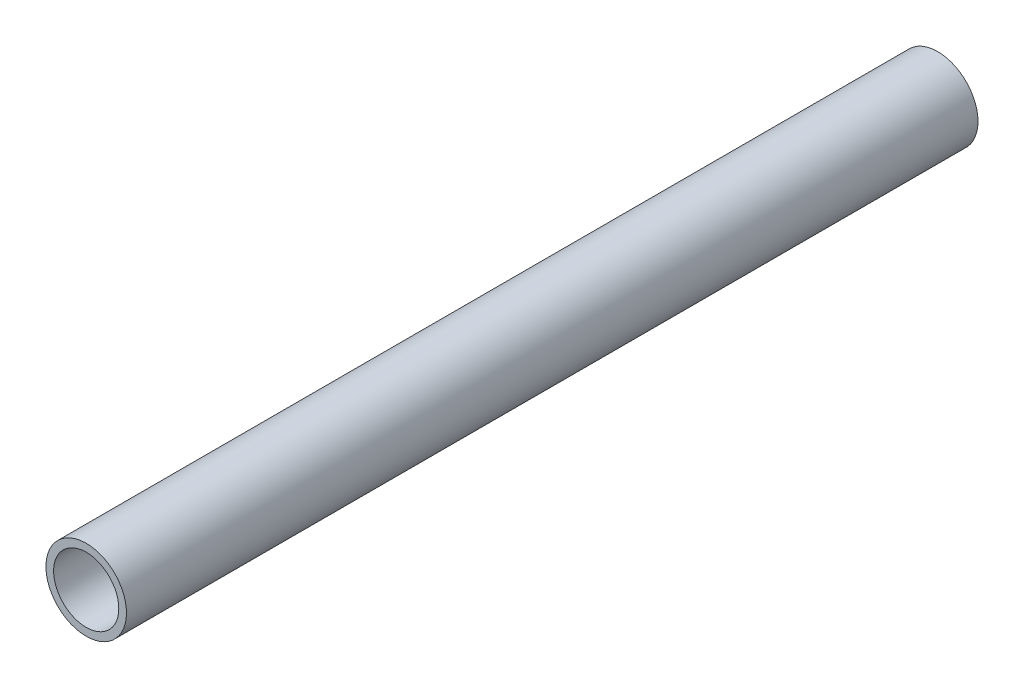
ISO-10303-21;
HEADER;
FILE_DESCRIPTION(('STEP AP214'),'2;1');
FILE_NAME('part.step','',(''),(''),'','','');
FILE_SCHEMA(('AUTOMOTIVE_DESIGN { 1 0 10303 214 1 1 1 1 }'));
ENDSEC;
DATA;
#1=APPLICATION_CONTEXT('core data for automotive mechanical design processes');
#2=APPLICATION_PROTOCOL_DEFINITION('international standard','automotive_design',2000,#1);
#3=PRODUCT_CONTEXT('',#1,'mechanical');
#4=PRODUCT('Part','Part','',(#3));
#5=PRODUCT_RELATED_PRODUCT_CATEGORY('part','',(#4));
#6=PRODUCT_DEFINITION_FORMATION('','',#4);
#7=PRODUCT_DEFINITION_CONTEXT('part definition',#1,'design');
#8=PRODUCT_DEFINITION('design','',#6,#7);
#9=PRODUCT_DEFINITION_SHAPE('','',#8);
#10=(LENGTH_UNIT() NAMED_UNIT(*) SI_UNIT(.MILLI.,.METRE.));
#11=(NAMED_UNIT(*) PLANE_ANGLE_UNIT() SI_UNIT($,.RADIAN.));
#12=(NAMED_UNIT(*) SI_UNIT($,.STERADIAN.) SOLID_ANGLE_UNIT());
#13=UNCERTAINTY_MEASURE_WITH_UNIT(LENGTH_MEASURE(1.E-05),#10,'distance_accuracy_value','');
#14=(GEOMETRIC_REPRESENTATION_CONTEXT(3) GLOBAL_UNCERTAINTY_ASSIGNED_CONTEXT((#13)) GLOBAL_UNIT_ASSIGNED_CONTEXT((#10,
#11,#12)) REPRESENTATION_CONTEXT('',''));
#15=CARTESIAN_POINT('',(0.,0.,0.));
#16=DIRECTION('',(0.,0.,1.));
#17=DIRECTION('',(1.,0.,0.));
#18=AXIS2_PLACEMENT_3D('',#15,#16,#17);
#19=CARTESIAN_POINT('',(0.,0.,1850.));
#20=DIRECTION('',(0.,0.,1.));
#21=DIRECTION('',(1.,0.,0.));
#22=AXIS2_PLACEMENT_3D('',#19,#20,#21);
#23=PLANE('',#22);
#24=CARTESIAN_POINT('',(0.,0.,1850.));
#25=DIRECTION('',(0.,0.,1.));
#26=DIRECTION('',(1.,0.,0.));
#27=AXIS2_PLACEMENT_3D('',#24,#25,#26);
#28=CIRCLE('',#27,175.);
#29=CARTESIAN_POINT('',(175.,0.,1850.));
#30=VERTEX_POINT('',#29);
#31=EDGE_CURVE('E10',#30,#30,#28,.T.);
#32=ORIENTED_EDGE('',*,*,#31,.T.);
#33=EDGE_LOOP('',(#32));
#34=FACE_BOUND('',#33,.T.);
#35=CARTESIAN_POINT('',(0.,0.,1850.));
#36=DIRECTION('',(0.,0.,1.));
#37=DIRECTION('',(1.,0.,0.));
#38=AXIS2_PLACEMENT_3D('',#35,#36,#37);
#39=CIRCLE('',#38,141.5);
#40=CARTESIAN_POINT('',(141.5,0.,1850.));
#41=VERTEX_POINT('',#40);
#42=EDGE_CURVE('E42',#41,#41,#39,.T.);
#43=ORIENTED_EDGE('',*,*,#42,.F.);
#44=EDGE_LOOP('',(#43));
#45=FACE_BOUND('',#44,.T.);
#46=ADVANCED_FACE('F31',(#34,#45),#23,.T.);
#47=CARTESIAN_POINT('',(0.,0.,-1850.));
#48=DIRECTION('',(0.,0.,1.));
#49=DIRECTION('',(1.,0.,0.));
#50=AXIS2_PLACEMENT_3D('',#47,#48,#49);
#51=PLANE('',#50);
#52=CARTESIAN_POINT('',(0.,0.,-1850.));
#53=DIRECTION('',(0.,0.,1.));
#54=DIRECTION('',(1.,0.,0.));
#55=AXIS2_PLACEMENT_3D('',#52,#53,#54);
#56=CIRCLE('',#55,175.);
#57=CARTESIAN_POINT('',(175.,0.,-1850.));
#58=VERTEX_POINT('',#57);
#59=EDGE_CURVE('E35',#58,#58,#56,.T.);
#60=ORIENTED_EDGE('',*,*,#59,.F.);
#61=EDGE_LOOP('',(#60));
#62=FACE_BOUND('',#61,.T.);
#63=CARTESIAN_POINT('',(0.,0.,-1850.));
#64=DIRECTION('',(0.,0.,1.));
#65=DIRECTION('',(1.,0.,0.));
#66=AXIS2_PLACEMENT_3D('',#63,#64,#65);
#67=CIRCLE('',#66,141.5);
#68=CARTESIAN_POINT('',(141.5,0.,-1850.));
#69=VERTEX_POINT('',#68);
#70=EDGE_CURVE('E44',#69,#69,#67,.T.);
#71=ORIENTED_EDGE('',*,*,#70,.T.);
#72=EDGE_LOOP('',(#71));
#73=FACE_BOUND('',#72,.T.);
#74=ADVANCED_FACE('F54',(#62,#73),#51,.F.);
#75=CARTESIAN_POINT('',(0.,0.,1850.));
#76=DIRECTION('',(0.,0.,-1.));
#77=DIRECTION('',(-1.,0.,0.));
#78=AXIS2_PLACEMENT_3D('',#75,#76,#77);
#79=CYLINDRICAL_SURFACE('',#78,175.);
#80=ORIENTED_EDGE('',*,*,#31,.F.);
#81=EDGE_LOOP('',(#80));
#82=FACE_BOUND('',#81,.T.);
#83=ORIENTED_EDGE('',*,*,#59,.T.);
#84=EDGE_LOOP('',(#83));
#85=FACE_BOUND('',#84,.T.);
#86=ADVANCED_FACE('F33',(#82,#85),#79,.T.);
#87=CARTESIAN_POINT('',(0.,0.,1850.));
#88=DIRECTION('',(0.,0.,-1.));
#89=DIRECTION('',(-1.,0.,0.));
#90=AXIS2_PLACEMENT_3D('',#87,#88,#89);
#91=CYLINDRICAL_SURFACE('',#90,141.5);
#92=ORIENTED_EDGE('',*,*,#42,.T.);
#93=EDGE_LOOP('',(#92));
#94=FACE_BOUND('',#93,.T.);
#95=ORIENTED_EDGE('',*,*,#70,.F.);
#96=EDGE_LOOP('',(#95));
#97=FACE_BOUND('',#96,.T.);
#98=ADVANCED_FACE('F50',(#94,#97),#91,.F.);
#99=CLOSED_SHELL('',(#46,#74,#86,#98));
#100=MANIFOLD_SOLID_BREP('B2',#99);
#101=ADVANCED_BREP_SHAPE_REPRESENTATION('',(#18,#100),#14);
#102=SHAPE_DEFINITION_REPRESENTATION(#9,#101);
ENDSEC;
END-ISO-10303-21;
